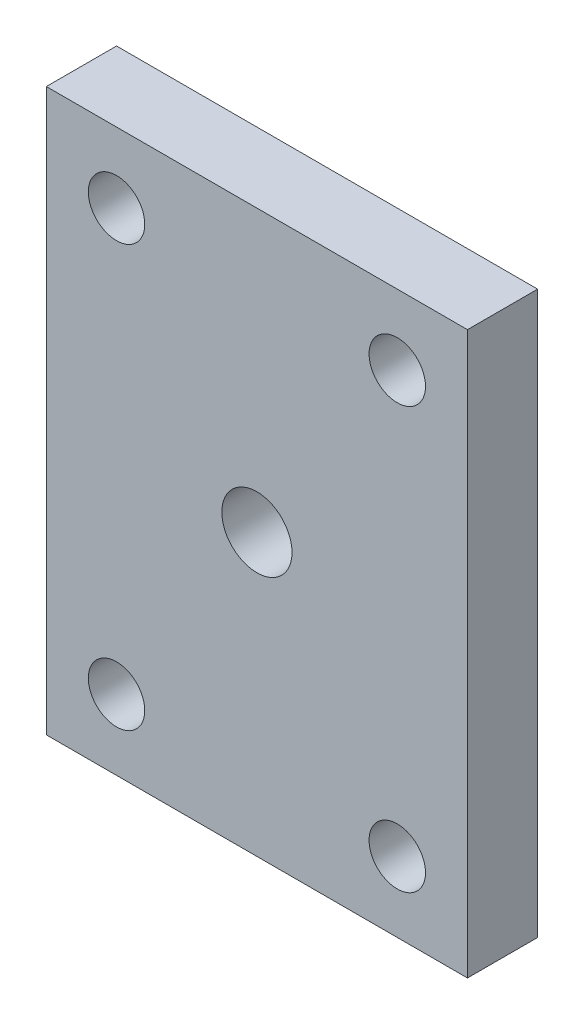
ISO-10303-21;
HEADER;
FILE_DESCRIPTION(('STEP AP214'),'2;1');
FILE_NAME('part.step','',(''),(''),'','','');
FILE_SCHEMA(('AUTOMOTIVE_DESIGN { 1 0 10303 214 1 1 1 1 }'));
ENDSEC;
DATA;
#1=APPLICATION_CONTEXT('core data for automotive mechanical design processes');
#2=APPLICATION_PROTOCOL_DEFINITION('international standard','automotive_design',2000,#1);
#3=PRODUCT_CONTEXT('',#1,'mechanical');
#4=PRODUCT('Part','Part','',(#3));
#5=PRODUCT_RELATED_PRODUCT_CATEGORY('part','',(#4));
#6=PRODUCT_DEFINITION_FORMATION('','',#4);
#7=PRODUCT_DEFINITION_CONTEXT('part definition',#1,'design');
#8=PRODUCT_DEFINITION('design','',#6,#7);
#9=PRODUCT_DEFINITION_SHAPE('','',#8);
#10=(LENGTH_UNIT() NAMED_UNIT(*) SI_UNIT(.MILLI.,.METRE.));
#11=(NAMED_UNIT(*) PLANE_ANGLE_UNIT() SI_UNIT($,.RADIAN.));
#12=(NAMED_UNIT(*) SI_UNIT($,.STERADIAN.) SOLID_ANGLE_UNIT());
#13=UNCERTAINTY_MEASURE_WITH_UNIT(LENGTH_MEASURE(1.E-05),#10,'distance_accuracy_value','');
#14=(GEOMETRIC_REPRESENTATION_CONTEXT(3) GLOBAL_UNCERTAINTY_ASSIGNED_CONTEXT((#13)) GLOBAL_UNIT_ASSIGNED_CONTEXT((#10,
#11,#12)) REPRESENTATION_CONTEXT('',''));
#15=CARTESIAN_POINT('',(0.,0.,0.));
#16=DIRECTION('',(0.,0.,1.));
#17=DIRECTION('',(1.,0.,0.));
#18=AXIS2_PLACEMENT_3D('',#15,#16,#17);
#19=CARTESIAN_POINT('',(0.,0.,6.35));
#20=DIRECTION('',(0.,0.,-1.));
#21=DIRECTION('',(-1.,0.,0.));
#22=AXIS2_PLACEMENT_3D('',#19,#20,#21);
#23=PLANE('',#22);
#24=DIRECTION('',(0.,-1.,0.));
#25=VECTOR('',#24,1.);
#26=CARTESIAN_POINT('',(0.,0.,6.35));
#27=LINE('',#26,#25);
#28=CARTESIAN_POINT('',(0.,50.8,6.35));
#29=VERTEX_POINT('',#28);
#30=CARTESIAN_POINT('',(0.,0.,6.35));
#31=VERTEX_POINT('',#30);
#32=EDGE_CURVE('E86',#29,#31,#27,.T.);
#33=ORIENTED_EDGE('',*,*,#32,.T.);
#34=DIRECTION('',(1.,0.,0.));
#35=VECTOR('',#34,1.);
#36=CARTESIAN_POINT('',(0.,0.,6.35));
#37=LINE('',#36,#35);
#38=CARTESIAN_POINT('',(38.1,0.,6.35));
#39=VERTEX_POINT('',#38);
#40=EDGE_CURVE('E81',#31,#39,#37,.T.);
#41=ORIENTED_EDGE('',*,*,#40,.T.);
#42=DIRECTION('',(0.,1.,0.));
#43=VECTOR('',#42,1.);
#44=CARTESIAN_POINT('',(38.1,0.,6.35));
#45=LINE('',#44,#43);
#46=CARTESIAN_POINT('',(38.1,50.8,6.35));
#47=VERTEX_POINT('',#46);
#48=EDGE_CURVE('E84',#39,#47,#45,.T.);
#49=ORIENTED_EDGE('',*,*,#48,.T.);
#50=DIRECTION('',(-1.,0.,0.));
#51=VECTOR('',#50,1.);
#52=CARTESIAN_POINT('',(0.,50.8,6.35));
#53=LINE('',#52,#51);
#54=EDGE_CURVE('E51',#47,#29,#53,.T.);
#55=ORIENTED_EDGE('',*,*,#54,.T.);
#56=EDGE_LOOP('',(#33,#41,#49,#55));
#57=FACE_BOUND('',#56,.T.);
#58=CARTESIAN_POINT('',(19.05,25.4,6.35));
#59=DIRECTION('',(0.,0.,1.));
#60=DIRECTION('',(1.,0.,0.));
#61=AXIS2_PLACEMENT_3D('',#58,#59,#60);
#62=CIRCLE('',#61,3.175);
#63=CARTESIAN_POINT('',(22.225,25.4,6.35));
#64=VERTEX_POINT('',#63);
#65=EDGE_CURVE('E101',#64,#64,#62,.T.);
#66=ORIENTED_EDGE('',*,*,#65,.F.);
#67=EDGE_LOOP('',(#66));
#68=FACE_BOUND('',#67,.T.);
#69=CARTESIAN_POINT('',(6.34999999999999,44.45,6.35));
#70=DIRECTION('',(0.,0.,1.));
#71=DIRECTION('',(1.,0.,0.));
#72=AXIS2_PLACEMENT_3D('',#69,#70,#71);
#73=CIRCLE('',#72,2.5527);
#74=CARTESIAN_POINT('',(8.90269999999999,44.45,6.35));
#75=VERTEX_POINT('',#74);
#76=EDGE_CURVE('E116',#75,#75,#73,.T.);
#77=ORIENTED_EDGE('',*,*,#76,.F.);
#78=EDGE_LOOP('',(#77));
#79=FACE_BOUND('',#78,.T.);
#80=CARTESIAN_POINT('',(31.75,44.45,6.35));
#81=DIRECTION('',(0.,0.,1.));
#82=DIRECTION('',(1.,0.,0.));
#83=AXIS2_PLACEMENT_3D('',#80,#81,#82);
#84=CIRCLE('',#83,2.55269999999999);
#85=CARTESIAN_POINT('',(34.3027,44.45,6.35));
#86=VERTEX_POINT('',#85);
#87=EDGE_CURVE('E122',#86,#86,#84,.T.);
#88=ORIENTED_EDGE('',*,*,#87,.F.);
#89=EDGE_LOOP('',(#88));
#90=FACE_BOUND('',#89,.T.);
#91=CARTESIAN_POINT('',(31.75,6.35,6.35));
#92=DIRECTION('',(0.,0.,1.));
#93=DIRECTION('',(1.,0.,0.));
#94=AXIS2_PLACEMENT_3D('',#91,#92,#93);
#95=CIRCLE('',#94,2.55269999999999);
#96=CARTESIAN_POINT('',(34.3027,6.35,6.35));
#97=VERTEX_POINT('',#96);
#98=EDGE_CURVE('E128',#97,#97,#95,.T.);
#99=ORIENTED_EDGE('',*,*,#98,.F.);
#100=EDGE_LOOP('',(#99));
#101=FACE_BOUND('',#100,.T.);
#102=CARTESIAN_POINT('',(6.34999999999999,6.35,6.35));
#103=DIRECTION('',(0.,0.,1.));
#104=DIRECTION('',(1.,0.,0.));
#105=AXIS2_PLACEMENT_3D('',#102,#103,#104);
#106=CIRCLE('',#105,2.5527);
#107=CARTESIAN_POINT('',(8.90269999999999,6.35,6.35));
#108=VERTEX_POINT('',#107);
#109=EDGE_CURVE('E134',#108,#108,#106,.T.);
#110=ORIENTED_EDGE('',*,*,#109,.F.);
#111=EDGE_LOOP('',(#110));
#112=FACE_BOUND('',#111,.T.);
#113=ADVANCED_FACE('F34',(#57,#68,#79,#90,#101,#112),#23,.F.);
#114=CARTESIAN_POINT('',(0.,0.,0.));
#115=DIRECTION('',(0.,0.,-1.));
#116=DIRECTION('',(-1.,0.,0.));
#117=AXIS2_PLACEMENT_3D('',#114,#115,#116);
#118=PLANE('',#117);
#119=CARTESIAN_POINT('',(31.75,6.35,0.));
#120=DIRECTION('',(0.,0.,1.));
#121=DIRECTION('',(1.,0.,0.));
#122=AXIS2_PLACEMENT_3D('',#119,#120,#121);
#123=CIRCLE('',#122,2.55269999999999);
#124=CARTESIAN_POINT('',(34.3027,6.35,0.));
#125=VERTEX_POINT('',#124);
#126=EDGE_CURVE('E131',#125,#125,#123,.T.);
#127=ORIENTED_EDGE('',*,*,#126,.T.);
#128=EDGE_LOOP('',(#127));
#129=FACE_BOUND('',#128,.T.);
#130=CARTESIAN_POINT('',(6.34999999999999,44.45,0.));
#131=DIRECTION('',(0.,0.,1.));
#132=DIRECTION('',(1.,0.,0.));
#133=AXIS2_PLACEMENT_3D('',#130,#131,#132);
#134=CIRCLE('',#133,2.5527);
#135=CARTESIAN_POINT('',(8.90269999999999,44.45,0.));
#136=VERTEX_POINT('',#135);
#137=EDGE_CURVE('E119',#136,#136,#134,.T.);
#138=ORIENTED_EDGE('',*,*,#137,.T.);
#139=EDGE_LOOP('',(#138));
#140=FACE_BOUND('',#139,.T.);
#141=DIRECTION('',(0.,-1.,0.));
#142=VECTOR('',#141,1.);
#143=CARTESIAN_POINT('',(0.,0.,0.));
#144=LINE('',#143,#142);
#145=CARTESIAN_POINT('',(0.,50.8,0.));
#146=VERTEX_POINT('',#145);
#147=CARTESIAN_POINT('',(0.,0.,0.));
#148=VERTEX_POINT('',#147);
#149=EDGE_CURVE('E98',#146,#148,#144,.T.);
#150=ORIENTED_EDGE('',*,*,#149,.F.);
#151=DIRECTION('',(-1.,0.,0.));
#152=VECTOR('',#151,1.);
#153=CARTESIAN_POINT('',(0.,50.8,0.));
#154=LINE('',#153,#152);
#155=CARTESIAN_POINT('',(38.1,50.8,0.));
#156=VERTEX_POINT('',#155);
#157=EDGE_CURVE('E74',#156,#146,#154,.T.);
#158=ORIENTED_EDGE('',*,*,#157,.F.);
#159=DIRECTION('',(0.,1.,0.));
#160=VECTOR('',#159,1.);
#161=CARTESIAN_POINT('',(38.1,0.,0.));
#162=LINE('',#161,#160);
#163=CARTESIAN_POINT('',(38.1,0.,0.));
#164=VERTEX_POINT('',#163);
#165=EDGE_CURVE('E68',#164,#156,#162,.T.);
#166=ORIENTED_EDGE('',*,*,#165,.F.);
#167=DIRECTION('',(1.,0.,0.));
#168=VECTOR('',#167,1.);
#169=CARTESIAN_POINT('',(0.,0.,0.));
#170=LINE('',#169,#168);
#171=EDGE_CURVE('E90',#148,#164,#170,.T.);
#172=ORIENTED_EDGE('',*,*,#171,.F.);
#173=EDGE_LOOP('',(#150,#158,#166,#172));
#174=FACE_BOUND('',#173,.T.);
#175=CARTESIAN_POINT('',(19.05,25.4,0.));
#176=DIRECTION('',(0.,0.,1.));
#177=DIRECTION('',(1.,0.,0.));
#178=AXIS2_PLACEMENT_3D('',#175,#176,#177);
#179=CIRCLE('',#178,3.175);
#180=CARTESIAN_POINT('',(22.225,25.4,0.));
#181=VERTEX_POINT('',#180);
#182=EDGE_CURVE('E113',#181,#181,#179,.T.);
#183=ORIENTED_EDGE('',*,*,#182,.T.);
#184=EDGE_LOOP('',(#183));
#185=FACE_BOUND('',#184,.T.);
#186=CARTESIAN_POINT('',(31.75,44.45,0.));
#187=DIRECTION('',(0.,0.,1.));
#188=DIRECTION('',(1.,0.,0.));
#189=AXIS2_PLACEMENT_3D('',#186,#187,#188);
#190=CIRCLE('',#189,2.55269999999999);
#191=CARTESIAN_POINT('',(34.3027,44.45,0.));
#192=VERTEX_POINT('',#191);
#193=EDGE_CURVE('E125',#192,#192,#190,.T.);
#194=ORIENTED_EDGE('',*,*,#193,.T.);
#195=EDGE_LOOP('',(#194));
#196=FACE_BOUND('',#195,.T.);
#197=CARTESIAN_POINT('',(6.34999999999999,6.35,0.));
#198=DIRECTION('',(0.,0.,1.));
#199=DIRECTION('',(1.,0.,0.));
#200=AXIS2_PLACEMENT_3D('',#197,#198,#199);
#201=CIRCLE('',#200,2.5527);
#202=CARTESIAN_POINT('',(8.90269999999999,6.35,0.));
#203=VERTEX_POINT('',#202);
#204=EDGE_CURVE('E137',#203,#203,#201,.T.);
#205=ORIENTED_EDGE('',*,*,#204,.T.);
#206=EDGE_LOOP('',(#205));
#207=FACE_BOUND('',#206,.T.);
#208=ADVANCED_FACE('F109',(#129,#140,#174,#185,#196,#207),#118,.T.);
#209=CARTESIAN_POINT('',(0.,0.,6.35));
#210=DIRECTION('',(1.,0.,0.));
#211=DIRECTION('',(0.,0.,-1.));
#212=AXIS2_PLACEMENT_3D('',#209,#210,#211);
#213=PLANE('',#212);
#214=ORIENTED_EDGE('',*,*,#149,.T.);
#215=DIRECTION('',(0.,0.,-1.));
#216=VECTOR('',#215,1.);
#217=CARTESIAN_POINT('',(0.,0.,6.35));
#218=LINE('',#217,#216);
#219=EDGE_CURVE('E11',#31,#148,#218,.T.);
#220=ORIENTED_EDGE('',*,*,#219,.F.);
#221=ORIENTED_EDGE('',*,*,#32,.F.);
#222=DIRECTION('',(0.,0.,-1.));
#223=VECTOR('',#222,1.);
#224=CARTESIAN_POINT('',(0.,50.8,6.35));
#225=LINE('',#224,#223);
#226=EDGE_CURVE('E94',#29,#146,#225,.T.);
#227=ORIENTED_EDGE('',*,*,#226,.T.);
#228=EDGE_LOOP('',(#214,#220,#221,#227));
#229=FACE_BOUND('',#228,.T.);
#230=ADVANCED_FACE('F36',(#229),#213,.F.);
#231=CARTESIAN_POINT('',(0.,0.,6.35));
#232=DIRECTION('',(0.,1.,0.));
#233=DIRECTION('',(0.,0.,1.));
#234=AXIS2_PLACEMENT_3D('',#231,#232,#233);
#235=PLANE('',#234);
#236=ORIENTED_EDGE('',*,*,#171,.T.);
#237=DIRECTION('',(0.,0.,-1.));
#238=VECTOR('',#237,1.);
#239=CARTESIAN_POINT('',(38.1,0.,6.35));
#240=LINE('',#239,#238);
#241=EDGE_CURVE('E43',#39,#164,#240,.T.);
#242=ORIENTED_EDGE('',*,*,#241,.F.);
#243=ORIENTED_EDGE('',*,*,#40,.F.);
#244=ORIENTED_EDGE('',*,*,#219,.T.);
#245=EDGE_LOOP('',(#236,#242,#243,#244));
#246=FACE_BOUND('',#245,.T.);
#247=ADVANCED_FACE('F89',(#246),#235,.F.);
#248=CARTESIAN_POINT('',(38.1,0.,6.35));
#249=DIRECTION('',(-1.,0.,0.));
#250=DIRECTION('',(0.,0.,1.));
#251=AXIS2_PLACEMENT_3D('',#248,#249,#250);
#252=PLANE('',#251);
#253=ORIENTED_EDGE('',*,*,#165,.T.);
#254=DIRECTION('',(0.,0.,-1.));
#255=VECTOR('',#254,1.);
#256=CARTESIAN_POINT('',(38.1,50.8,6.35));
#257=LINE('',#256,#255);
#258=EDGE_CURVE('E91',#47,#156,#257,.T.);
#259=ORIENTED_EDGE('',*,*,#258,.F.);
#260=ORIENTED_EDGE('',*,*,#48,.F.);
#261=ORIENTED_EDGE('',*,*,#241,.T.);
#262=EDGE_LOOP('',(#253,#259,#260,#261));
#263=FACE_BOUND('',#262,.T.);
#264=ADVANCED_FACE('F92',(#263),#252,.F.);
#265=CARTESIAN_POINT('',(0.,50.8,6.35));
#266=DIRECTION('',(0.,-1.,0.));
#267=DIRECTION('',(0.,0.,-1.));
#268=AXIS2_PLACEMENT_3D('',#265,#266,#267);
#269=PLANE('',#268);
#270=ORIENTED_EDGE('',*,*,#157,.T.);
#271=ORIENTED_EDGE('',*,*,#226,.F.);
#272=ORIENTED_EDGE('',*,*,#54,.F.);
#273=ORIENTED_EDGE('',*,*,#258,.T.);
#274=EDGE_LOOP('',(#270,#271,#272,#273));
#275=FACE_BOUND('',#274,.T.);
#276=ADVANCED_FACE('F106',(#275),#269,.F.);
#277=CARTESIAN_POINT('',(19.05,25.4,6.35));
#278=DIRECTION('',(0.,0.,-1.));
#279=DIRECTION('',(-1.,0.,0.));
#280=AXIS2_PLACEMENT_3D('',#277,#278,#279);
#281=CYLINDRICAL_SURFACE('',#280,3.175);
#282=ORIENTED_EDGE('',*,*,#65,.T.);
#283=EDGE_LOOP('',(#282));
#284=FACE_BOUND('',#283,.T.);
#285=ORIENTED_EDGE('',*,*,#182,.F.);
#286=EDGE_LOOP('',(#285));
#287=FACE_BOUND('',#286,.T.);
#288=ADVANCED_FACE('F154',(#284,#287),#281,.F.);
#289=CARTESIAN_POINT('',(6.34999999999999,44.45,6.35));
#290=DIRECTION('',(0.,0.,-1.));
#291=DIRECTION('',(-1.,0.,0.));
#292=AXIS2_PLACEMENT_3D('',#289,#290,#291);
#293=CYLINDRICAL_SURFACE('',#292,2.5527);
#294=ORIENTED_EDGE('',*,*,#76,.T.);
#295=EDGE_LOOP('',(#294));
#296=FACE_BOUND('',#295,.T.);
#297=ORIENTED_EDGE('',*,*,#137,.F.);
#298=EDGE_LOOP('',(#297));
#299=FACE_BOUND('',#298,.T.);
#300=ADVANCED_FACE('F200',(#296,#299),#293,.F.);
#301=CARTESIAN_POINT('',(31.75,44.45,6.35));
#302=DIRECTION('',(0.,0.,-1.));
#303=DIRECTION('',(-1.,0.,0.));
#304=AXIS2_PLACEMENT_3D('',#301,#302,#303);
#305=CYLINDRICAL_SURFACE('',#304,2.55269999999999);
#306=ORIENTED_EDGE('',*,*,#87,.T.);
#307=EDGE_LOOP('',(#306));
#308=FACE_BOUND('',#307,.T.);
#309=ORIENTED_EDGE('',*,*,#193,.F.);
#310=EDGE_LOOP('',(#309));
#311=FACE_BOUND('',#310,.T.);
#312=ADVANCED_FACE('F208',(#308,#311),#305,.F.);
#313=CARTESIAN_POINT('',(31.75,6.35,6.35));
#314=DIRECTION('',(0.,0.,-1.));
#315=DIRECTION('',(-1.,0.,0.));
#316=AXIS2_PLACEMENT_3D('',#313,#314,#315);
#317=CYLINDRICAL_SURFACE('',#316,2.55269999999999);
#318=ORIENTED_EDGE('',*,*,#98,.T.);
#319=EDGE_LOOP('',(#318));
#320=FACE_BOUND('',#319,.T.);
#321=ORIENTED_EDGE('',*,*,#126,.F.);
#322=EDGE_LOOP('',(#321));
#323=FACE_BOUND('',#322,.T.);
#324=ADVANCED_FACE('F216',(#320,#323),#317,.F.);
#325=CARTESIAN_POINT('',(6.34999999999999,6.35,6.35));
#326=DIRECTION('',(0.,0.,-1.));
#327=DIRECTION('',(-1.,0.,0.));
#328=AXIS2_PLACEMENT_3D('',#325,#326,#327);
#329=CYLINDRICAL_SURFACE('',#328,2.5527);
#330=ORIENTED_EDGE('',*,*,#109,.T.);
#331=EDGE_LOOP('',(#330));
#332=FACE_BOUND('',#331,.T.);
#333=ORIENTED_EDGE('',*,*,#204,.F.);
#334=EDGE_LOOP('',(#333));
#335=FACE_BOUND('',#334,.T.);
#336=ADVANCED_FACE('F143',(#332,#335),#329,.F.);
#337=CLOSED_SHELL('',(#113,#208,#230,#247,#264,#276,#288,#300,#312,#324,#336));
#338=MANIFOLD_SOLID_BREP('B2',#337);
#339=ADVANCED_BREP_SHAPE_REPRESENTATION('',(#18,#338),#14);
#340=SHAPE_DEFINITION_REPRESENTATION(#9,#339);
ENDSEC;
END-ISO-10303-21;
